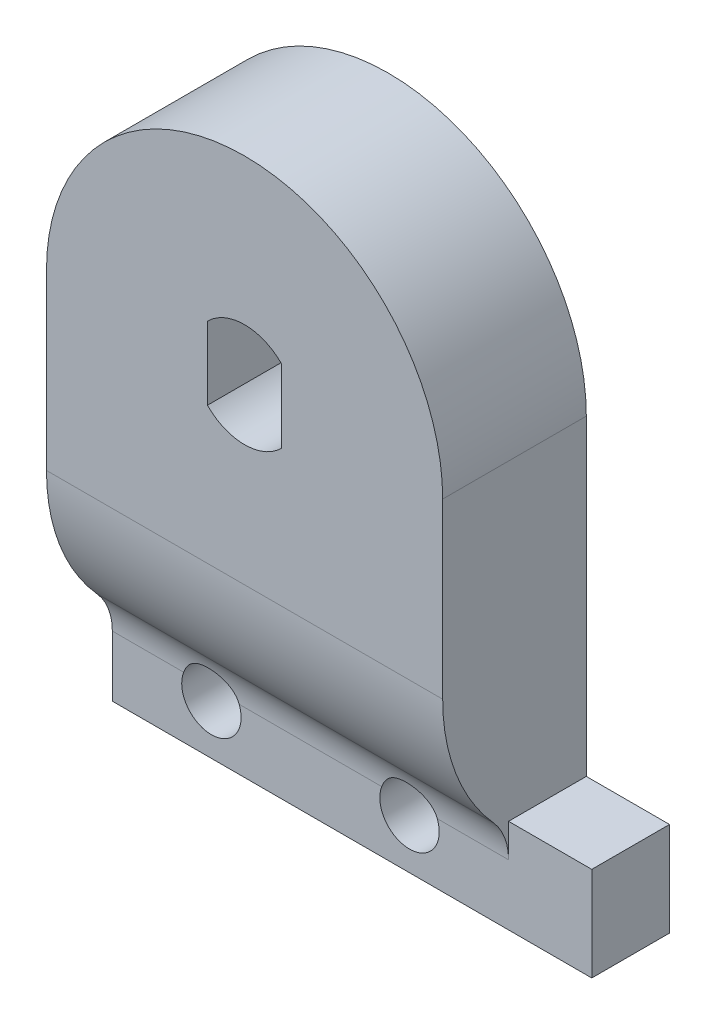
ISO-10303-21;
HEADER;
FILE_DESCRIPTION(('STEP AP214'),'2;1');
FILE_NAME('part.step','',(''),(''),'','','');
FILE_SCHEMA(('AUTOMOTIVE_DESIGN { 1 0 10303 214 1 1 1 1 }'));
ENDSEC;
DATA;
#1=APPLICATION_CONTEXT('core data for automotive mechanical design processes');
#2=APPLICATION_PROTOCOL_DEFINITION('international standard','automotive_design',2000,#1);
#3=PRODUCT_CONTEXT('',#1,'mechanical');
#4=PRODUCT('Part','Part','',(#3));
#5=PRODUCT_RELATED_PRODUCT_CATEGORY('part','',(#4));
#6=PRODUCT_DEFINITION_FORMATION('','',#4);
#7=PRODUCT_DEFINITION_CONTEXT('part definition',#1,'design');
#8=PRODUCT_DEFINITION('design','',#6,#7);
#9=PRODUCT_DEFINITION_SHAPE('','',#8);
#10=(LENGTH_UNIT() NAMED_UNIT(*) SI_UNIT(.MILLI.,.METRE.));
#11=(NAMED_UNIT(*) PLANE_ANGLE_UNIT() SI_UNIT($,.RADIAN.));
#12=(NAMED_UNIT(*) SI_UNIT($,.STERADIAN.) SOLID_ANGLE_UNIT());
#13=UNCERTAINTY_MEASURE_WITH_UNIT(LENGTH_MEASURE(1.E-05),#10,'distance_accuracy_value','');
#14=(GEOMETRIC_REPRESENTATION_CONTEXT(3) GLOBAL_UNCERTAINTY_ASSIGNED_CONTEXT((#13)) GLOBAL_UNIT_ASSIGNED_CONTEXT((#10,
#11,#12)) REPRESENTATION_CONTEXT('',''));
#15=CARTESIAN_POINT('',(0.,0.,0.));
#16=DIRECTION('',(0.,0.,1.));
#17=DIRECTION('',(1.,0.,0.));
#18=AXIS2_PLACEMENT_3D('',#15,#16,#17);
#19=CARTESIAN_POINT('',(44.2641007815363,-13.9999999999999,8.));
#20=DIRECTION('',(1.,0.,0.));
#21=DIRECTION('',(0.,0.,-1.));
#22=AXIS2_PLACEMENT_3D('',#19,#20,#21);
#23=PLANE('',#22);
#24=DIRECTION('',(0.,1.,0.));
#25=VECTOR('',#24,1.);
#26=CARTESIAN_POINT('',(44.2641007815363,-29.7499999999998,0.75));
#27=LINE('',#26,#25);
#28=CARTESIAN_POINT('',(44.2641007815363,-34.4999999999998,0.75));
#29=VERTEX_POINT('',#28);
#30=CARTESIAN_POINT('',(44.2641007815363,-13.9999999999999,0.75));
#31=VERTEX_POINT('',#30);
#32=EDGE_CURVE('E151',#29,#31,#27,.T.);
#33=ORIENTED_EDGE('',*,*,#32,.F.);
#34=DIRECTION('',(0.,0.,1.));
#35=VECTOR('',#34,1.);
#36=CARTESIAN_POINT('',(44.2641007815363,-34.4999999999998,4.67499999999996));
#37=LINE('',#36,#35);
#38=CARTESIAN_POINT('',(44.2641007815363,-34.4999999999998,4.67499999999996));
#39=VERTEX_POINT('',#38);
#40=EDGE_CURVE('E145',#29,#39,#37,.T.);
#41=ORIENTED_EDGE('',*,*,#40,.T.);
#42=DIRECTION('',(0.,1.,0.));
#43=VECTOR('',#42,1.);
#44=CARTESIAN_POINT('',(44.2641007815363,-31.432993435446,4.67499999999996));
#45=LINE('',#44,#43);
#46=CARTESIAN_POINT('',(44.2641007815363,-31.432993435446,4.67499999999995));
#47=VERTEX_POINT('',#46);
#48=EDGE_CURVE('E148',#39,#47,#45,.T.);
#49=ORIENTED_EDGE('',*,*,#48,.T.);
#50=CARTESIAN_POINT('',(44.2641007815363,-31.432993435446,7.67499999999995));
#51=DIRECTION('',(1.,0.,0.));
#52=DIRECTION('',(0.,0.,1.));
#53=AXIS2_PLACEMENT_3D('',#50,#51,#52);
#54=CIRCLE('',#53,3.);
#55=CARTESIAN_POINT('',(44.2641007815363,-29.4292257195738,5.44230769230766));
#56=VERTEX_POINT('',#55);
#57=EDGE_CURVE('E163',#47,#56,#54,.T.);
#58=ORIENTED_EDGE('',*,*,#57,.T.);
#59=CARTESIAN_POINT('',(44.2641007815363,-22.7499999999998,-2.));
#60=DIRECTION('',(1.,0.,0.));
#61=DIRECTION('',(0.,0.,-1.));
#62=AXIS2_PLACEMENT_3D('',#59,#60,#61);
#63=CIRCLE('',#62,10.);
#64=CARTESIAN_POINT('',(44.2641007815363,-22.7499999999998,8.));
#65=VERTEX_POINT('',#64);
#66=EDGE_CURVE('E246',#56,#65,#63,.F.);
#67=ORIENTED_EDGE('',*,*,#66,.T.);
#68=DIRECTION('',(0.,-1.,0.));
#69=VECTOR('',#68,1.);
#70=CARTESIAN_POINT('',(44.2641007815363,-13.9999999999999,8.));
#71=LINE('',#70,#69);
#72=CARTESIAN_POINT('',(44.2641007815363,-13.9999999999999,8.));
#73=VERTEX_POINT('',#72);
#74=EDGE_CURVE('E233',#73,#65,#71,.T.);
#75=ORIENTED_EDGE('',*,*,#74,.F.);
#76=DIRECTION('',(0.,0.,-1.));
#77=VECTOR('',#76,1.);
#78=CARTESIAN_POINT('',(44.2641007815363,-13.9999999999999,8.));
#79=LINE('',#78,#77);
#80=EDGE_CURVE('E242',#73,#31,#79,.T.);
#81=ORIENTED_EDGE('',*,*,#80,.T.);
#82=EDGE_LOOP('',(#33,#41,#49,#58,#67,#75,#81));
#83=FACE_BOUND('',#82,.T.);
#84=ADVANCED_FACE('F37',(#83),#23,.F.);
#85=CARTESIAN_POINT('',(64.2641007815364,-29.7499999999998,-55.4339173674038));
#86=DIRECTION('',(0.,-1.,0.));
#87=DIRECTION('',(0.,0.,-1.));
#88=AXIS2_PLACEMENT_3D('',#85,#86,#87);
#89=PLANE('',#88);
#90=DIRECTION('',(1.,0.,0.));
#91=VECTOR('',#90,1.);
#92=CARTESIAN_POINT('',(64.2641007815364,-29.7499999999998,0.750000000000001));
#93=LINE('',#92,#91);
#94=CARTESIAN_POINT('',(64.2641007815364,-29.7499999999998,0.750000000000001));
#95=VERTEX_POINT('',#94);
#96=CARTESIAN_POINT('',(68.4641007815364,-29.7499999999998,0.75));
#97=VERTEX_POINT('',#96);
#98=EDGE_CURVE('E178',#95,#97,#93,.T.);
#99=ORIENTED_EDGE('',*,*,#98,.F.);
#100=DIRECTION('',(0.,0.,1.));
#101=VECTOR('',#100,1.);
#102=CARTESIAN_POINT('',(64.2641007815364,-29.7499999999998,8.));
#103=LINE('',#102,#101);
#104=CARTESIAN_POINT('',(64.2641007815364,-29.7499999999998,4.67499999999996));
#105=VERTEX_POINT('',#104);
#106=EDGE_CURVE('E192',#95,#105,#103,.T.);
#107=ORIENTED_EDGE('',*,*,#106,.T.);
#108=DIRECTION('',(1.,0.,0.));
#109=VECTOR('',#108,1.);
#110=CARTESIAN_POINT('',(63.6186870544907,-29.7499999999998,4.67499999999996));
#111=LINE('',#110,#109);
#112=CARTESIAN_POINT('',(68.4641007815364,-29.7499999999998,4.67499999999996));
#113=VERTEX_POINT('',#112);
#114=EDGE_CURVE('E183',#105,#113,#111,.T.);
#115=ORIENTED_EDGE('',*,*,#114,.T.);
#116=DIRECTION('',(0.,0.,-1.));
#117=VECTOR('',#116,1.);
#118=CARTESIAN_POINT('',(68.4641007815364,-29.7499999999998,8.));
#119=LINE('',#118,#117);
#120=EDGE_CURVE('E195',#113,#97,#119,.T.);
#121=ORIENTED_EDGE('',*,*,#120,.T.);
#122=EDGE_LOOP('',(#99,#107,#115,#121));
#123=FACE_BOUND('',#122,.T.);
#124=ADVANCED_FACE('F282',(#123),#89,.F.);
#125=CARTESIAN_POINT('',(68.4641007815364,-42.5841809112374,-2.50000000000004));
#126=DIRECTION('',(-1.,0.,0.));
#127=DIRECTION('',(0.,0.,1.));
#128=AXIS2_PLACEMENT_3D('',#125,#126,#127);
#129=PLANE('',#128);
#130=DIRECTION('',(0.,-1.,0.));
#131=VECTOR('',#130,1.);
#132=CARTESIAN_POINT('',(68.4641007815364,-30.1960979714209,4.67499999999996));
#133=LINE('',#132,#131);
#134=CARTESIAN_POINT('',(68.4641007815364,-34.4999999999998,4.67499999999996));
#135=VERTEX_POINT('',#134);
#136=EDGE_CURVE('E188',#113,#135,#133,.T.);
#137=ORIENTED_EDGE('',*,*,#136,.T.);
#138=DIRECTION('',(0.,0.,1.));
#139=VECTOR('',#138,1.);
#140=CARTESIAN_POINT('',(68.4641007815364,-34.4999999999989,8.));
#141=LINE('',#140,#139);
#142=CARTESIAN_POINT('',(68.4641007815364,-34.4999999999998,0.75));
#143=VERTEX_POINT('',#142);
#144=EDGE_CURVE('E167',#143,#135,#141,.T.);
#145=ORIENTED_EDGE('',*,*,#144,.F.);
#146=DIRECTION('',(0.,-1.,0.));
#147=VECTOR('',#146,1.);
#148=CARTESIAN_POINT('',(68.4641007815364,-34.4999999999998,0.75));
#149=LINE('',#148,#147);
#150=EDGE_CURVE('E169',#97,#143,#149,.T.);
#151=ORIENTED_EDGE('',*,*,#150,.F.);
#152=ORIENTED_EDGE('',*,*,#120,.F.);
#153=EDGE_LOOP('',(#137,#145,#151,#152));
#154=FACE_BOUND('',#153,.T.);
#155=ADVANCED_FACE('F276',(#154),#129,.F.);
#156=CARTESIAN_POINT('',(56.2641007815364,-34.4999999999998,4.67499999999996));
#157=DIRECTION('',(0.,-1.,0.));
#158=DIRECTION('',(0.,0.,-1.));
#159=AXIS2_PLACEMENT_3D('',#156,#157,#158);
#160=PLANE('',#159);
#161=ORIENTED_EDGE('',*,*,#40,.F.);
#162=DIRECTION('',(-1.,0.,0.));
#163=VECTOR('',#162,1.);
#164=CARTESIAN_POINT('',(68.4641007815364,-34.4999999999998,0.75));
#165=LINE('',#164,#163);
#166=EDGE_CURVE('E171',#143,#29,#165,.T.);
#167=ORIENTED_EDGE('',*,*,#166,.F.);
#168=ORIENTED_EDGE('',*,*,#144,.T.);
#169=DIRECTION('',(-1.,0.,0.));
#170=VECTOR('',#169,1.);
#171=CARTESIAN_POINT('',(69.8783143439095,-34.4999999999998,4.67499999999996));
#172=LINE('',#171,#170);
#173=EDGE_CURVE('E160',#135,#39,#172,.T.);
#174=ORIENTED_EDGE('',*,*,#173,.T.);
#175=EDGE_LOOP('',(#161,#167,#168,#174));
#176=FACE_BOUND('',#175,.T.);
#177=ADVANCED_FACE('F165',(#176),#160,.T.);
#178=CARTESIAN_POINT('',(59.2641007815363,-31.9646128597868,-28.));
#179=DIRECTION('',(0.,0.,1.));
#180=DIRECTION('',(1.,0.,0.));
#181=AXIS2_PLACEMENT_3D('',#178,#179,#180);
#182=CYLINDRICAL_SURFACE('',#181,1.5);
#183=CARTESIAN_POINT('',(57.8614672628781,-31.432993435446,4.67499999999995));
#184=CARTESIAN_POINT('',(57.8905351969613,-31.356313199977,4.67500314403333));
#185=CARTESIAN_POINT('',(57.9259412826313,-31.2819562733326,4.67796667743639));
#186=CARTESIAN_POINT('',(58.0082848743271,-31.1401889312916,4.68847211900364));
#187=CARTESIAN_POINT('',(58.0552445361,-31.0727922199422,4.69602286521372));
#188=CARTESIAN_POINT('',(58.1590864797405,-30.946982483888,4.71394977751054));
#189=CARTESIAN_POINT('',(58.2159339739823,-30.8885392712706,4.72431610724775));
#190=CARTESIAN_POINT('',(58.338194111731,-30.7816968721352,4.7460427298524));
#191=CARTESIAN_POINT('',(58.4036056668758,-30.7332964113525,4.75740289635751));
#192=CARTESIAN_POINT('',(58.5444588190816,-30.6457962484212,4.77975359402547));
#193=CARTESIAN_POINT('',(58.6202099986338,-30.6071836455321,4.79070745835738));
#194=CARTESIAN_POINT('',(58.777454224866,-30.5432140250815,4.80979224109244));
#195=CARTESIAN_POINT('',(58.8589460505222,-30.5178541982843,4.81792375763533));
#196=CARTESIAN_POINT('',(59.0239730730645,-30.4815912053632,4.82979399182506));
#197=CARTESIAN_POINT('',(59.1074511582754,-30.4704529434594,4.83360402614734));
#198=CARTESIAN_POINT('',(59.2751627745851,-30.4623074844926,4.83637524162235));
#199=CARTESIAN_POINT('',(59.3593960946352,-30.4652964553428,4.83533773769642));
#200=CARTESIAN_POINT('',(59.5222193685981,-30.4848165798267,4.82876493565629));
#201=CARTESIAN_POINT('',(59.6008927259389,-30.500732456763,4.82343408131985));
#202=CARTESIAN_POINT('',(59.7544299748945,-30.5447681329138,4.80941368093745));
#203=CARTESIAN_POINT('',(59.8292930457287,-30.5728905492338,4.80072341467086));
#204=CARTESIAN_POINT('',(59.97518835872,-30.6413556575037,4.78110934983329));
#205=CARTESIAN_POINT('',(60.046079286399,-30.6819844976158,4.77013544096591));
#206=CARTESIAN_POINT('',(60.1803268357982,-30.7741659547394,4.74785279034464));
#207=CARTESIAN_POINT('',(60.2436809798132,-30.8257221486913,4.73654393999691));
#208=CARTESIAN_POINT('',(60.3638974288669,-30.9410502871762,4.71500428682771));
#209=CARTESIAN_POINT('',(60.4203579070841,-31.0052557696872,4.70484170093883));
#210=CARTESIAN_POINT('',(60.5217392218721,-31.1426479123439,4.68828356953832));
#211=CARTESIAN_POINT('',(60.5666638684875,-31.2158315953456,4.6818867793583));
#212=CARTESIAN_POINT('',(60.6420716133165,-31.3662684366982,4.67483228984156));
#213=CARTESIAN_POINT('',(60.6730174596529,-31.4432793513059,4.67397576714087));
#214=CARTESIAN_POINT('',(60.7217411385435,-31.6011578210443,4.67867852731586));
#215=CARTESIAN_POINT('',(60.7395262141679,-31.6820232287189,4.68423427686184));
#216=CARTESIAN_POINT('',(60.7607965546,-31.8391250879013,4.70164007904868));
#217=CARTESIAN_POINT('',(60.7651901707445,-31.9152924163712,4.71302559050636));
#218=CARTESIAN_POINT('',(60.7625540567552,-32.0663146486848,4.74160405788756));
#219=CARTESIAN_POINT('',(60.7555232154192,-32.141169424147,4.75879757859947));
#220=CARTESIAN_POINT('',(60.7306487152274,-32.2884682080586,4.79853489080101));
#221=CARTESIAN_POINT('',(60.7126857806908,-32.3608761883924,4.82113600767854));
#222=CARTESIAN_POINT('',(60.6668775297469,-32.5009460082514,4.87053903199488));
#223=CARTESIAN_POINT('',(60.6390298239862,-32.5686066955177,4.89734195422142));
#224=CARTESIAN_POINT('',(60.5708518380334,-32.705482758741,4.95710488925076));
#225=CARTESIAN_POINT('',(60.5294706762182,-32.7740188153254,4.99041833010023));
#226=CARTESIAN_POINT('',(60.4368964443848,-32.9031624922151,5.05890380091048));
#227=CARTESIAN_POINT('',(60.3856906244186,-32.9637596359242,5.09407820249572));
#228=CARTESIAN_POINT('',(60.2667713098761,-33.0838698767573,5.16895529967573));
#229=CARTESIAN_POINT('',(60.1977615927129,-33.1421262627322,5.2086265556115));
#230=CARTESIAN_POINT('',(60.0489592128074,-33.2461016234704,5.28402661242211));
#231=CARTESIAN_POINT('',(59.9691800704988,-33.2918361042285,5.31976025619709));
#232=CARTESIAN_POINT('',(59.8238156013071,-33.3578666016649,5.37366549071028));
#233=CARTESIAN_POINT('',(59.7606222301458,-33.3816985775829,5.39394359291961));
#234=CARTESIAN_POINT('',(59.6300175731454,-33.4208876005341,5.42801203001535));
#235=CARTESIAN_POINT('',(59.5626131866599,-33.4362581253803,5.44181267730941));
#236=CARTESIAN_POINT('',(59.424553497476,-33.4576515887253,5.46118408816184));
#237=CARTESIAN_POINT('',(59.3538764151949,-33.4635983819606,5.46668779391903));
#238=CARTESIAN_POINT('',(59.2122865113986,-33.4653871507649,5.46833294531659));
#239=CARTESIAN_POINT('',(59.1413737439488,-33.461231302938,5.46447640761267));
#240=CARTESIAN_POINT('',(59.0098141187493,-33.4442203424482,5.44900135076973));
#241=CARTESIAN_POINT('',(58.9489138217425,-33.4324031881345,5.43831085953663));
#242=CARTESIAN_POINT('',(58.8301893174331,-33.4017926793689,5.41132056010683));
#243=CARTESIAN_POINT('',(58.7723677951229,-33.3829933461232,5.39501594544809));
#244=CARTESIAN_POINT('',(58.6377970932507,-33.3302210417367,5.35075018451321));
#245=CARTESIAN_POINT('',(58.5629221917756,-33.2931864896136,5.32074565904682));
#246=CARTESIAN_POINT('',(58.4216578396435,-33.2084374560991,5.25619001280382));
#247=CARTESIAN_POINT('',(58.3552821020202,-33.160706048655,5.22163172253145));
#248=CARTESIAN_POINT('',(58.2304846805721,-33.0547718222631,5.15032536391708));
#249=CARTESIAN_POINT('',(58.1722212888293,-32.9964014273871,5.11354967597669));
#250=CARTESIAN_POINT('',(58.0657855726871,-32.8706086531321,5.04088878372327));
#251=CARTESIAN_POINT('',(58.0176130657444,-32.8031864375363,5.00500356331209));
#252=CARTESIAN_POINT('',(57.9276957570148,-32.6520638576877,4.93243771948099));
#253=CARTESIAN_POINT('',(57.8872787110229,-32.5673858438956,4.89611966041895));
#254=CARTESIAN_POINT('',(57.8224878869317,-32.3896649496212,4.83005142055265));
#255=CARTESIAN_POINT('',(57.7981043157186,-32.2966272147374,4.80029723798134));
#256=CARTESIAN_POINT('',(57.7692857549199,-32.1160365043674,4.75246972310036));
#257=CARTESIAN_POINT('',(57.7629170839407,-32.0290419433271,4.73345953711122));
#258=CARTESIAN_POINT('',(57.7656395522434,-31.8540266088968,4.7033733719303));
#259=CARTESIAN_POINT('',(57.7746945156388,-31.7660087164245,4.69227891309168));
#260=CARTESIAN_POINT('',(57.7995959621934,-31.6374154530048,4.68167413282523));
#261=CARTESIAN_POINT('',(57.809509162071,-31.5958433020205,4.67914022693855));
#262=CARTESIAN_POINT('',(57.8328626351841,-31.5136345519112,4.67580246362784));
#263=CARTESIAN_POINT('',(57.846302405655,-31.4729978203258,4.67499835974519));
#264=CARTESIAN_POINT('',(57.8614672628781,-31.432993435446,4.67499999999995));
#265=B_SPLINE_CURVE_WITH_KNOTS('',3,(#183,#184,#185,#186,#187,#188,#189,#190,#191,#192,#193,
#194,#195,#196,#197,#198,#199,#200,#201,#202,#203,#204,#205,#206,#207,#208,#209,#210,#211,#212,
#213,#214,#215,#216,#217,#218,#219,#220,#221,#222,#223,#224,#225,#226,#227,#228,#229,#230,#231,
#232,#233,#234,#235,#236,#237,#238,#239,#240,#241,#242,#243,#244,#245,#246,#247,#248,#249,#250,
#251,#252,#253,#254,#255,#256,#257,#258,#259,#260,#261,#262,#263,#264),.UNSPECIFIED.,.T.,.F.,(4,
2,2,2,2,2,2,2,2,2,2,2,2,2,2,2,2,2,2,2,2,2,2,2,2,2,2,2,2,2,2,2,2,2,2,2,2,2,2,2,4),(0.,
0.24584263724966,0.492160440983074,0.737628552881246,0.983065499732747,1.23901380886139,
1.494907841735,1.74651448866019,1.99805288986491,2.2382752355539,2.47854911083427,
2.72479025180429,2.97111212174008,3.22813975584287,3.48508238957078,3.7327504388118,
3.98028208160891,4.21060146721951,4.44094325623466,4.67384442589395,4.90680193095566,
5.16593118930089,5.42539903540851,5.71998390552178,6.01420232134983,6.22497311611074,
6.43540720619403,6.64753312262325,6.85961334077913,7.04768723238372,7.23592254312532,
7.50076800137192,7.76603553160844,8.03591343425972,8.30578645441611,8.60594128294028,
8.90591260865847,9.17217717152422,9.43781807474397,9.56609343739053,9.69435052241715),.UNSPECIFIED.);
#266=CARTESIAN_POINT('',(57.8614672628781,-31.432993435446,4.67499999999995));
#267=VERTEX_POINT('',#266);
#268=CARTESIAN_POINT('',(60.6667343001946,-31.432993435446,4.67499999999996));
#269=VERTEX_POINT('',#268);
#270=EDGE_CURVE('E47',#267,#269,#265,.T.);
#271=ORIENTED_EDGE('',*,*,#270,.F.);
#272=CARTESIAN_POINT('',(59.2641007815363,-31.9646128597868,4.67499999999995));
#273=DIRECTION('',(0.,0.,-1.));
#274=DIRECTION('',(0.,1.,0.));
#275=AXIS2_PLACEMENT_3D('',#272,#273,#274);
#276=CIRCLE('',#275,1.5);
#277=EDGE_CURVE('E59',#269,#267,#276,.T.);
#278=ORIENTED_EDGE('',*,*,#277,.F.);
#279=EDGE_LOOP('',(#271,#278));
#280=FACE_BOUND('',#279,.T.);
#281=CARTESIAN_POINT('',(59.2641007815363,-31.9646128597868,0.750000000000001));
#282=DIRECTION('',(0.,0.,-1.));
#283=DIRECTION('',(0.,1.,0.));
#284=AXIS2_PLACEMENT_3D('',#281,#282,#283);
#285=CIRCLE('',#284,1.5);
#286=CARTESIAN_POINT('',(59.2641007815363,-30.4646128597868,0.750000000000001));
#287=VERTEX_POINT('',#286);
#288=EDGE_CURVE('E175',#287,#287,#285,.F.);
#289=ORIENTED_EDGE('',*,*,#288,.F.);
#290=EDGE_LOOP('',(#289));
#291=FACE_BOUND('',#290,.T.);
#292=ADVANCED_FACE('F268',(#280,#291),#182,.F.);
#293=CARTESIAN_POINT('',(49.2641007815364,-31.9646128597868,-28.));
#294=DIRECTION('',(0.,0.,1.));
#295=DIRECTION('',(1.,0.,0.));
#296=AXIS2_PLACEMENT_3D('',#293,#294,#295);
#297=CYLINDRICAL_SURFACE('',#296,1.5);
#298=CARTESIAN_POINT('',(47.8614672628781,-31.432993435446,4.67499999999995));
#299=CARTESIAN_POINT('',(47.8905351969613,-31.356313199977,4.67500314403333));
#300=CARTESIAN_POINT('',(47.9259412826314,-31.2819562733326,4.67796667743639));
#301=CARTESIAN_POINT('',(48.0082848743271,-31.1401889312916,4.68847211900364));
#302=CARTESIAN_POINT('',(48.0552445361,-31.0727922199422,4.69602286521372));
#303=CARTESIAN_POINT('',(48.1590864797405,-30.946982483888,4.71394977751054));
#304=CARTESIAN_POINT('',(48.2159339739823,-30.8885392712706,4.72431610724775));
#305=CARTESIAN_POINT('',(48.338194111731,-30.7816968721352,4.7460427298524));
#306=CARTESIAN_POINT('',(48.4036056668758,-30.7332964113525,4.75740289635751));
#307=CARTESIAN_POINT('',(48.5444588190816,-30.6457962484212,4.77975359402547));
#308=CARTESIAN_POINT('',(48.6202099986339,-30.6071836455321,4.79070745835738));
#309=CARTESIAN_POINT('',(48.777454224866,-30.5432140250815,4.80979224109244));
#310=CARTESIAN_POINT('',(48.8589460505222,-30.5178541982843,4.81792375763533));
#311=CARTESIAN_POINT('',(49.0239730730645,-30.4815912053632,4.82979399182506));
#312=CARTESIAN_POINT('',(49.1074511582754,-30.4704529434594,4.83360402614734));
#313=CARTESIAN_POINT('',(49.2751627745851,-30.4623074844926,4.83637524162235));
#314=CARTESIAN_POINT('',(49.3593960946352,-30.4652964553428,4.83533773769642));
#315=CARTESIAN_POINT('',(49.5222193685981,-30.4848165798267,4.82876493565629));
#316=CARTESIAN_POINT('',(49.6008927259389,-30.500732456763,4.82343408131985));
#317=CARTESIAN_POINT('',(49.7544299748945,-30.5447681329138,4.80941368093745));
#318=CARTESIAN_POINT('',(49.8292930457287,-30.5728905492338,4.80072341467086));
#319=CARTESIAN_POINT('',(49.97518835872,-30.6413556575037,4.78110934983329));
#320=CARTESIAN_POINT('',(50.046079286399,-30.6819844976158,4.77013544096591));
#321=CARTESIAN_POINT('',(50.1803268357982,-30.7741659547394,4.74785279034464));
#322=CARTESIAN_POINT('',(50.2436809798132,-30.8257221486913,4.73654393999691));
#323=CARTESIAN_POINT('',(50.3638974288669,-30.9410502871762,4.71500428682771));
#324=CARTESIAN_POINT('',(50.4203579070841,-31.0052557696872,4.70484170093883));
#325=CARTESIAN_POINT('',(50.5217392218721,-31.1426479123439,4.68828356953832));
#326=CARTESIAN_POINT('',(50.5666638684875,-31.2158315953456,4.6818867793583));
#327=CARTESIAN_POINT('',(50.6420716133165,-31.3662684366982,4.67483228984156));
#328=CARTESIAN_POINT('',(50.6730174596529,-31.4432793513059,4.67397576714087));
#329=CARTESIAN_POINT('',(50.7217411385435,-31.6011578210443,4.67867852731586));
#330=CARTESIAN_POINT('',(50.7395262141679,-31.6820232287189,4.68423427686184));
#331=CARTESIAN_POINT('',(50.7607965546,-31.8391250879013,4.70164007904868));
#332=CARTESIAN_POINT('',(50.7651901707445,-31.9152924163712,4.71302559050636));
#333=CARTESIAN_POINT('',(50.7625540567552,-32.0663146486848,4.74160405788756));
#334=CARTESIAN_POINT('',(50.7555232154192,-32.141169424147,4.75879757859947));
#335=CARTESIAN_POINT('',(50.7306487152274,-32.2884682080586,4.79853489080101));
#336=CARTESIAN_POINT('',(50.7126857806908,-32.3608761883924,4.82113600767854));
#337=CARTESIAN_POINT('',(50.6668775297469,-32.5009460082514,4.87053903199488));
#338=CARTESIAN_POINT('',(50.6390298239862,-32.5686066955177,4.89734195422142));
#339=CARTESIAN_POINT('',(50.5708518380334,-32.705482758741,4.95710488925076));
#340=CARTESIAN_POINT('',(50.5294706762182,-32.7740188153254,4.99041833010023));
#341=CARTESIAN_POINT('',(50.4368964443848,-32.9031624922151,5.05890380091048));
#342=CARTESIAN_POINT('',(50.3856906244186,-32.9637596359242,5.09407820249572));
#343=CARTESIAN_POINT('',(50.2667713098761,-33.0838698767573,5.16895529967573));
#344=CARTESIAN_POINT('',(50.1977615927129,-33.1421262627322,5.2086265556115));
#345=CARTESIAN_POINT('',(50.0489592128074,-33.2461016234704,5.28402661242211));
#346=CARTESIAN_POINT('',(49.9691800704988,-33.2918361042285,5.31976025619709));
#347=CARTESIAN_POINT('',(49.8238156013071,-33.3578666016649,5.37366549071028));
#348=CARTESIAN_POINT('',(49.7606222301458,-33.3816985775829,5.39394359291961));
#349=CARTESIAN_POINT('',(49.6300175731454,-33.4208876005341,5.42801203001535));
#350=CARTESIAN_POINT('',(49.5626131866599,-33.4362581253803,5.44181267730941));
#351=CARTESIAN_POINT('',(49.424553497476,-33.4576515887253,5.46118408816184));
#352=CARTESIAN_POINT('',(49.3538764151949,-33.4635983819606,5.46668779391903));
#353=CARTESIAN_POINT('',(49.2122865113986,-33.4653871507649,5.46833294531659));
#354=CARTESIAN_POINT('',(49.1413737439488,-33.461231302938,5.46447640761267));
#355=CARTESIAN_POINT('',(49.0098141187493,-33.4442203424482,5.44900135076973));
#356=CARTESIAN_POINT('',(48.9489138217425,-33.4324031881345,5.43831085953663));
#357=CARTESIAN_POINT('',(48.8301893174331,-33.4017926793689,5.41132056010683));
#358=CARTESIAN_POINT('',(48.772367795123,-33.3829933461232,5.39501594544809));
#359=CARTESIAN_POINT('',(48.6377970932507,-33.3302210417367,5.35075018451321));
#360=CARTESIAN_POINT('',(48.5629221917756,-33.2931864896136,5.32074565904682));
#361=CARTESIAN_POINT('',(48.4216578396435,-33.2084374560991,5.25619001280381));
#362=CARTESIAN_POINT('',(48.3552821020202,-33.160706048655,5.22163172253145));
#363=CARTESIAN_POINT('',(48.2304846805721,-33.0547718222631,5.15032536391708));
#364=CARTESIAN_POINT('',(48.1722212888293,-32.9964014273871,5.11354967597669));
#365=CARTESIAN_POINT('',(48.0657855726871,-32.8706086531321,5.04088878372327));
#366=CARTESIAN_POINT('',(48.0176130657444,-32.8031864375363,5.00500356331209));
#367=CARTESIAN_POINT('',(47.9276957570148,-32.6520638576877,4.93243771948099));
#368=CARTESIAN_POINT('',(47.8872787110229,-32.5673858438956,4.89611966041895));
#369=CARTESIAN_POINT('',(47.8224878869317,-32.3896649496212,4.83005142055265));
#370=CARTESIAN_POINT('',(47.7981043157186,-32.2966272147374,4.80029723798134));
#371=CARTESIAN_POINT('',(47.7692857549199,-32.1160365043674,4.75246972310036));
#372=CARTESIAN_POINT('',(47.7629170839407,-32.0290419433271,4.73345953711122));
#373=CARTESIAN_POINT('',(47.7656395522434,-31.8540266088968,4.7033733719303));
#374=CARTESIAN_POINT('',(47.7746945156388,-31.7660087164245,4.69227891309168));
#375=CARTESIAN_POINT('',(47.7995959621934,-31.6374154530048,4.68167413282523));
#376=CARTESIAN_POINT('',(47.809509162071,-31.5958433020205,4.67914022693855));
#377=CARTESIAN_POINT('',(47.8328626351841,-31.5136345519112,4.67580246362784));
#378=CARTESIAN_POINT('',(47.846302405655,-31.4729978203258,4.67499835974519));
#379=CARTESIAN_POINT('',(47.8614672628781,-31.432993435446,4.67499999999995));
#380=B_SPLINE_CURVE_WITH_KNOTS('',3,(#298,#299,#300,#301,#302,#303,#304,#305,#306,#307,#308,
#309,#310,#311,#312,#313,#314,#315,#316,#317,#318,#319,#320,#321,#322,#323,#324,#325,#326,#327,
#328,#329,#330,#331,#332,#333,#334,#335,#336,#337,#338,#339,#340,#341,#342,#343,#344,#345,#346,
#347,#348,#349,#350,#351,#352,#353,#354,#355,#356,#357,#358,#359,#360,#361,#362,#363,#364,#365,
#366,#367,#368,#369,#370,#371,#372,#373,#374,#375,#376,#377,#378,#379),.UNSPECIFIED.,.T.,.F.,(4,
2,2,2,2,2,2,2,2,2,2,2,2,2,2,2,2,2,2,2,2,2,2,2,2,2,2,2,2,2,2,2,2,2,2,2,2,2,2,2,4),(0.,
0.24584263724966,0.492160440983074,0.737628552881246,0.983065499732747,1.23901380886139,
1.494907841735,1.74651448866019,1.99805288986491,2.2382752355539,2.47854911083427,
2.72479025180429,2.97111212174008,3.22813975584287,3.48508238957078,3.7327504388118,
3.98028208160891,4.21060146721951,4.44094325623466,4.67384442589395,4.90680193095566,
5.16593118930089,5.42539903540851,5.71998390552178,6.01420232134983,6.22497311611074,
6.43540720619403,6.64753312262325,6.85961334077913,7.04768723238372,7.23592254312532,
7.50076800137192,7.76603553160844,8.03591343425972,8.30578645441611,8.60594128294028,
8.90591260865847,9.17217717152422,9.43781807474397,9.56609343739053,9.69435052241715),.UNSPECIFIED.);
#381=CARTESIAN_POINT('',(47.8614672628781,-31.432993435446,4.67499999999995));
#382=VERTEX_POINT('',#381);
#383=CARTESIAN_POINT('',(50.6667343001946,-31.432993435446,4.67499999999996));
#384=VERTEX_POINT('',#383);
#385=EDGE_CURVE('E11',#382,#384,#380,.T.);
#386=ORIENTED_EDGE('',*,*,#385,.F.);
#387=CARTESIAN_POINT('',(49.2641007815364,-31.9646128597868,4.67499999999995));
#388=DIRECTION('',(0.,0.,-1.));
#389=DIRECTION('',(0.,1.,0.));
#390=AXIS2_PLACEMENT_3D('',#387,#388,#389);
#391=CIRCLE('',#390,1.5);
#392=EDGE_CURVE('E53',#384,#382,#391,.T.);
#393=ORIENTED_EDGE('',*,*,#392,.F.);
#394=EDGE_LOOP('',(#386,#393));
#395=FACE_BOUND('',#394,.T.);
#396=CARTESIAN_POINT('',(49.2641007815364,-31.9646128597868,0.750000000000001));
#397=DIRECTION('',(0.,0.,-1.));
#398=DIRECTION('',(0.,1.,0.));
#399=AXIS2_PLACEMENT_3D('',#396,#397,#398);
#400=CIRCLE('',#399,1.5);
#401=CARTESIAN_POINT('',(49.2641007815364,-30.4646128597868,0.750000000000001));
#402=VERTEX_POINT('',#401);
#403=EDGE_CURVE('E42',#402,#402,#400,.F.);
#404=ORIENTED_EDGE('',*,*,#403,.F.);
#405=EDGE_LOOP('',(#404));
#406=FACE_BOUND('',#405,.T.);
#407=ADVANCED_FACE('F272',(#395,#406),#297,.F.);
#408=CARTESIAN_POINT('',(54.2641007815363,-22.7499999999998,-2.));
#409=DIRECTION('',(1.,0.,0.));
#410=DIRECTION('',(0.,0.,-1.));
#411=AXIS2_PLACEMENT_3D('',#408,#409,#410);
#412=CYLINDRICAL_SURFACE('',#411,10.);
#413=ORIENTED_EDGE('',*,*,#66,.F.);
#414=DIRECTION('',(1.,0.,0.));
#415=VECTOR('',#414,1.);
#416=CARTESIAN_POINT('',(54.2641007815363,-29.4292257195738,5.44230769230766));
#417=LINE('',#416,#415);
#418=CARTESIAN_POINT('',(64.2641007815364,-29.4292257195738,5.44230769230766));
#419=VERTEX_POINT('',#418);
#420=EDGE_CURVE('E254',#56,#419,#417,.T.);
#421=ORIENTED_EDGE('',*,*,#420,.T.);
#422=CARTESIAN_POINT('',(64.2641007815364,-22.7499999999998,-2.));
#423=DIRECTION('',(1.,0.,0.));
#424=DIRECTION('',(0.,0.,-1.));
#425=AXIS2_PLACEMENT_3D('',#422,#423,#424);
#426=CIRCLE('',#425,10.);
#427=CARTESIAN_POINT('',(64.2641007815364,-22.7499999999998,8.));
#428=VERTEX_POINT('',#427);
#429=EDGE_CURVE('E190',#419,#428,#426,.F.);
#430=ORIENTED_EDGE('',*,*,#429,.T.);
#431=DIRECTION('',(-1.,0.,0.));
#432=VECTOR('',#431,1.);
#433=CARTESIAN_POINT('',(54.2641007815363,-22.7499999999998,8.));
#434=LINE('',#433,#432);
#435=EDGE_CURVE('E248',#65,#428,#434,.F.);
#436=ORIENTED_EDGE('',*,*,#435,.F.);
#437=EDGE_LOOP('',(#413,#421,#430,#436));
#438=FACE_BOUND('',#437,.T.);
#439=ADVANCED_FACE('F311',(#438),#412,.T.);
#440=CARTESIAN_POINT('',(54.2641007815363,-13.9999999999999,8.));
#441=DIRECTION('',(0.,0.,1.));
#442=DIRECTION('',(1.,0.,0.));
#443=AXIS2_PLACEMENT_3D('',#440,#441,#442);
#444=PLANE('',#443);
#445=DIRECTION('',(0.,1.,0.));
#446=VECTOR('',#445,1.);
#447=CARTESIAN_POINT('',(56.1391007815363,-12.1628826929125,8.));
#448=LINE('',#447,#446);
#449=CARTESIAN_POINT('',(56.1391007815363,-15.8371173070873,8.));
#450=VERTEX_POINT('',#449);
#451=CARTESIAN_POINT('',(56.1391007815363,-12.1628826929125,8.));
#452=VERTEX_POINT('',#451);
#453=EDGE_CURVE('E219',#450,#452,#448,.T.);
#454=ORIENTED_EDGE('',*,*,#453,.F.);
#455=CARTESIAN_POINT('',(54.2641007815363,-13.9999999999999,8.));
#456=DIRECTION('',(0.,0.,1.));
#457=DIRECTION('',(1.,0.,0.));
#458=AXIS2_PLACEMENT_3D('',#455,#456,#457);
#459=CIRCLE('',#458,2.625);
#460=CARTESIAN_POINT('',(52.3891007815363,-15.8371173070873,8.));
#461=VERTEX_POINT('',#460);
#462=EDGE_CURVE('E211',#461,#450,#459,.T.);
#463=ORIENTED_EDGE('',*,*,#462,.F.);
#464=DIRECTION('',(0.,-1.,0.));
#465=VECTOR('',#464,1.);
#466=CARTESIAN_POINT('',(52.3891007815363,-12.1628826929125,8.));
#467=LINE('',#466,#465);
#468=CARTESIAN_POINT('',(52.3891007815363,-12.1628826929125,8.));
#469=VERTEX_POINT('',#468);
#470=EDGE_CURVE('E212',#469,#461,#467,.T.);
#471=ORIENTED_EDGE('',*,*,#470,.F.);
#472=CARTESIAN_POINT('',(54.2641007815363,-13.9999999999999,8.));
#473=DIRECTION('',(0.,0.,1.));
#474=DIRECTION('',(1.,0.,0.));
#475=AXIS2_PLACEMENT_3D('',#472,#473,#474);
#476=CIRCLE('',#475,2.625);
#477=EDGE_CURVE('E216',#452,#469,#476,.T.);
#478=ORIENTED_EDGE('',*,*,#477,.F.);
#479=EDGE_LOOP('',(#454,#463,#471,#478));
#480=FACE_BOUND('',#479,.T.);
#481=ORIENTED_EDGE('',*,*,#435,.T.);
#482=DIRECTION('',(0.,-1.,0.));
#483=VECTOR('',#482,1.);
#484=CARTESIAN_POINT('',(64.2641007815364,-13.9999999999999,8.));
#485=LINE('',#484,#483);
#486=CARTESIAN_POINT('',(64.2641007815364,-13.9999999999999,8.));
#487=VERTEX_POINT('',#486);
#488=EDGE_CURVE('E236',#487,#428,#485,.T.);
#489=ORIENTED_EDGE('',*,*,#488,.F.);
#490=CARTESIAN_POINT('',(54.2641007815363,-13.9999999999999,8.));
#491=DIRECTION('',(0.,0.,1.));
#492=DIRECTION('',(1.,0.,0.));
#493=AXIS2_PLACEMENT_3D('',#490,#491,#492);
#494=CIRCLE('',#493,10.);
#495=EDGE_CURVE('E231',#487,#73,#494,.T.);
#496=ORIENTED_EDGE('',*,*,#495,.T.);
#497=ORIENTED_EDGE('',*,*,#74,.T.);
#498=EDGE_LOOP('',(#481,#489,#496,#497));
#499=FACE_BOUND('',#498,.T.);
#500=ADVANCED_FACE('F307',(#480,#499),#444,.T.);
#501=CARTESIAN_POINT('',(64.2641007815364,-13.9999999999999,8.));
#502=DIRECTION('',(1.,0.,0.));
#503=DIRECTION('',(0.,0.,-1.));
#504=AXIS2_PLACEMENT_3D('',#501,#502,#503);
#505=PLANE('',#504);
#506=ORIENTED_EDGE('',*,*,#429,.F.);
#507=CARTESIAN_POINT('',(64.2641007815364,-31.432993435446,7.67499999999995));
#508=DIRECTION('',(1.,0.,0.));
#509=DIRECTION('',(0.,0.,-1.));
#510=AXIS2_PLACEMENT_3D('',#507,#508,#509);
#511=CIRCLE('',#510,3.);
#512=CARTESIAN_POINT('',(64.2641007815364,-31.432993435446,4.67499999999996));
#513=VERTEX_POINT('',#512);
#514=EDGE_CURVE('E257',#419,#513,#511,.F.);
#515=ORIENTED_EDGE('',*,*,#514,.T.);
#516=DIRECTION('',(0.,-1.,0.));
#517=VECTOR('',#516,1.);
#518=CARTESIAN_POINT('',(64.2641007815364,-29.7499999999998,4.67499999999996));
#519=LINE('',#518,#517);
#520=EDGE_CURVE('E186',#105,#513,#519,.T.);
#521=ORIENTED_EDGE('',*,*,#520,.F.);
#522=ORIENTED_EDGE('',*,*,#106,.F.);
#523=DIRECTION('',(0.,-1.,0.));
#524=VECTOR('',#523,1.);
#525=CARTESIAN_POINT('',(64.2641007815364,-13.9999999999999,0.75));
#526=LINE('',#525,#524);
#527=CARTESIAN_POINT('',(64.2641007815364,-13.9999999999999,0.75));
#528=VERTEX_POINT('',#527);
#529=EDGE_CURVE('E194',#528,#95,#526,.T.);
#530=ORIENTED_EDGE('',*,*,#529,.F.);
#531=DIRECTION('',(0.,0.,-1.));
#532=VECTOR('',#531,1.);
#533=CARTESIAN_POINT('',(64.2641007815364,-13.9999999999999,8.));
#534=LINE('',#533,#532);
#535=EDGE_CURVE('E239',#487,#528,#534,.T.);
#536=ORIENTED_EDGE('',*,*,#535,.F.);
#537=ORIENTED_EDGE('',*,*,#488,.T.);
#538=EDGE_LOOP('',(#506,#515,#521,#522,#530,#536,#537));
#539=FACE_BOUND('',#538,.T.);
#540=ADVANCED_FACE('F310',(#539),#505,.T.);
#541=CARTESIAN_POINT('',(54.2641007815363,-13.9999999999999,8.));
#542=DIRECTION('',(0.,0.,-1.));
#543=DIRECTION('',(-1.,0.,0.));
#544=AXIS2_PLACEMENT_3D('',#541,#542,#543);
#545=CYLINDRICAL_SURFACE('',#544,10.);
#546=ORIENTED_EDGE('',*,*,#80,.F.);
#547=ORIENTED_EDGE('',*,*,#495,.F.);
#548=ORIENTED_EDGE('',*,*,#535,.T.);
#549=CARTESIAN_POINT('',(54.2641007815363,-13.9999999999999,0.75));
#550=DIRECTION('',(0.,0.,-1.));
#551=DIRECTION('',(-1.,0.,0.));
#552=AXIS2_PLACEMENT_3D('',#549,#550,#551);
#553=CIRCLE('',#552,10.);
#554=EDGE_CURVE('E203',#31,#528,#553,.T.);
#555=ORIENTED_EDGE('',*,*,#554,.F.);
#556=EDGE_LOOP('',(#546,#547,#548,#555));
#557=FACE_BOUND('',#556,.T.);
#558=ADVANCED_FACE('F302',(#557),#545,.T.);
#559=CARTESIAN_POINT('',(56.1391007815363,-12.1628826929125,-34.451743950282));
#560=DIRECTION('',(1.,0.,0.));
#561=DIRECTION('',(0.,0.,-1.));
#562=AXIS2_PLACEMENT_3D('',#559,#560,#561);
#563=PLANE('',#562);
#564=DIRECTION('',(0.,1.,0.));
#565=VECTOR('',#564,1.);
#566=CARTESIAN_POINT('',(56.1391007815363,-12.1628826929125,0.750000000000001));
#567=LINE('',#566,#565);
#568=CARTESIAN_POINT('',(56.1391007815363,-15.8371173070873,0.750000000000001));
#569=VERTEX_POINT('',#568);
#570=CARTESIAN_POINT('',(56.1391007815363,-12.1628826929125,0.750000000000001));
#571=VERTEX_POINT('',#570);
#572=EDGE_CURVE('E209',#569,#571,#567,.T.);
#573=ORIENTED_EDGE('',*,*,#572,.F.);
#574=DIRECTION('',(0.,0.,1.));
#575=VECTOR('',#574,1.);
#576=CARTESIAN_POINT('',(56.1391007815363,-15.8371173070873,-34.451743950282));
#577=LINE('',#576,#575);
#578=EDGE_CURVE('E226',#569,#450,#577,.T.);
#579=ORIENTED_EDGE('',*,*,#578,.T.);
#580=ORIENTED_EDGE('',*,*,#453,.T.);
#581=DIRECTION('',(0.,0.,1.));
#582=VECTOR('',#581,1.);
#583=CARTESIAN_POINT('',(56.1391007815363,-12.1628826929125,-34.451743950282));
#584=LINE('',#583,#582);
#585=EDGE_CURVE('E215',#571,#452,#584,.T.);
#586=ORIENTED_EDGE('',*,*,#585,.F.);
#587=EDGE_LOOP('',(#573,#579,#580,#586));
#588=FACE_BOUND('',#587,.T.);
#589=ADVANCED_FACE('F298',(#588),#563,.F.);
#590=CARTESIAN_POINT('',(54.2641007815363,-13.9999999999999,-34.451743950282));
#591=DIRECTION('',(0.,0.,1.));
#592=DIRECTION('',(1.,0.,0.));
#593=AXIS2_PLACEMENT_3D('',#590,#591,#592);
#594=CYLINDRICAL_SURFACE('',#593,2.625);
#595=CARTESIAN_POINT('',(54.2641007815363,-13.9999999999999,0.750000000000001));
#596=DIRECTION('',(0.,0.,-1.));
#597=DIRECTION('',(-1.,0.,0.));
#598=AXIS2_PLACEMENT_3D('',#595,#596,#597);
#599=CIRCLE('',#598,2.625);
#600=CARTESIAN_POINT('',(52.3891007815363,-12.1628826929125,0.750000000000001));
#601=VERTEX_POINT('',#600);
#602=EDGE_CURVE('E207',#571,#601,#599,.F.);
#603=ORIENTED_EDGE('',*,*,#602,.F.);
#604=ORIENTED_EDGE('',*,*,#585,.T.);
#605=ORIENTED_EDGE('',*,*,#477,.T.);
#606=DIRECTION('',(0.,0.,1.));
#607=VECTOR('',#606,1.);
#608=CARTESIAN_POINT('',(52.3891007815363,-12.1628826929125,-34.451743950282));
#609=LINE('',#608,#607);
#610=EDGE_CURVE('E227',#601,#469,#609,.T.);
#611=ORIENTED_EDGE('',*,*,#610,.F.);
#612=EDGE_LOOP('',(#603,#604,#605,#611));
#613=FACE_BOUND('',#612,.T.);
#614=ADVANCED_FACE('F294',(#613),#594,.F.);
#615=CARTESIAN_POINT('',(52.3891007815363,-12.1628826929125,-34.451743950282));
#616=DIRECTION('',(-1.,0.,0.));
#617=DIRECTION('',(0.,0.,1.));
#618=AXIS2_PLACEMENT_3D('',#615,#616,#617);
#619=PLANE('',#618);
#620=DIRECTION('',(0.,-1.,0.));
#621=VECTOR('',#620,1.);
#622=CARTESIAN_POINT('',(52.3891007815363,-12.1628826929125,0.750000000000001));
#623=LINE('',#622,#621);
#624=CARTESIAN_POINT('',(52.3891007815363,-15.8371173070873,0.750000000000001));
#625=VERTEX_POINT('',#624);
#626=EDGE_CURVE('E205',#601,#625,#623,.T.);
#627=ORIENTED_EDGE('',*,*,#626,.F.);
#628=ORIENTED_EDGE('',*,*,#610,.T.);
#629=ORIENTED_EDGE('',*,*,#470,.T.);
#630=DIRECTION('',(0.,0.,1.));
#631=VECTOR('',#630,1.);
#632=CARTESIAN_POINT('',(52.3891007815363,-15.8371173070873,-34.451743950282));
#633=LINE('',#632,#631);
#634=EDGE_CURVE('E224',#625,#461,#633,.T.);
#635=ORIENTED_EDGE('',*,*,#634,.F.);
#636=EDGE_LOOP('',(#627,#628,#629,#635));
#637=FACE_BOUND('',#636,.T.);
#638=ADVANCED_FACE('F290',(#637),#619,.F.);
#639=CARTESIAN_POINT('',(54.2641007815363,-13.9999999999999,-34.451743950282));
#640=DIRECTION('',(0.,0.,1.));
#641=DIRECTION('',(1.,0.,0.));
#642=AXIS2_PLACEMENT_3D('',#639,#640,#641);
#643=CYLINDRICAL_SURFACE('',#642,2.625);
#644=CARTESIAN_POINT('',(54.2641007815363,-13.9999999999999,0.750000000000001));
#645=DIRECTION('',(0.,0.,-1.));
#646=DIRECTION('',(-1.,0.,0.));
#647=AXIS2_PLACEMENT_3D('',#644,#645,#646);
#648=CIRCLE('',#647,2.625);
#649=EDGE_CURVE('E244',#625,#569,#648,.F.);
#650=ORIENTED_EDGE('',*,*,#649,.F.);
#651=ORIENTED_EDGE('',*,*,#634,.T.);
#652=ORIENTED_EDGE('',*,*,#462,.T.);
#653=ORIENTED_EDGE('',*,*,#578,.F.);
#654=EDGE_LOOP('',(#650,#651,#652,#653));
#655=FACE_BOUND('',#654,.T.);
#656=ADVANCED_FACE('F286',(#655),#643,.F.);
#657=CARTESIAN_POINT('',(54.2641007815363,-13.9999999999999,0.75));
#658=DIRECTION('',(0.,0.,-1.));
#659=DIRECTION('',(-1.,0.,0.));
#660=AXIS2_PLACEMENT_3D('',#657,#658,#659);
#661=PLANE('',#660);
#662=ORIENTED_EDGE('',*,*,#529,.T.);
#663=ORIENTED_EDGE('',*,*,#98,.T.);
#664=ORIENTED_EDGE('',*,*,#150,.T.);
#665=ORIENTED_EDGE('',*,*,#166,.T.);
#666=ORIENTED_EDGE('',*,*,#32,.T.);
#667=ORIENTED_EDGE('',*,*,#554,.T.);
#668=EDGE_LOOP('',(#662,#663,#664,#665,#666,#667));
#669=FACE_BOUND('',#668,.T.);
#670=ORIENTED_EDGE('',*,*,#572,.T.);
#671=ORIENTED_EDGE('',*,*,#602,.T.);
#672=ORIENTED_EDGE('',*,*,#626,.T.);
#673=ORIENTED_EDGE('',*,*,#649,.T.);
#674=EDGE_LOOP('',(#670,#671,#672,#673));
#675=FACE_BOUND('',#674,.T.);
#676=ORIENTED_EDGE('',*,*,#288,.T.);
#677=EDGE_LOOP('',(#676));
#678=FACE_BOUND('',#677,.T.);
#679=ORIENTED_EDGE('',*,*,#403,.T.);
#680=EDGE_LOOP('',(#679));
#681=FACE_BOUND('',#680,.T.);
#682=ADVANCED_FACE('F279',(#669,#675,#678,#681),#661,.T.);
#683=CARTESIAN_POINT('',(68.4641007815364,-30.1960979714209,4.67499999999996));
#684=DIRECTION('',(0.,0.,-1.));
#685=DIRECTION('',(0.,1.,0.));
#686=AXIS2_PLACEMENT_3D('',#683,#684,#685);
#687=PLANE('',#686);
#688=ORIENTED_EDGE('',*,*,#520,.T.);
#689=DIRECTION('',(1.,0.,0.));
#690=VECTOR('',#689,1.);
#691=CARTESIAN_POINT('',(68.4641007815364,-31.432993435446,4.67499999999996));
#692=LINE('',#691,#690);
#693=EDGE_CURVE('E251',#513,#269,#692,.F.);
#694=ORIENTED_EDGE('',*,*,#693,.T.);
#695=ORIENTED_EDGE('',*,*,#277,.T.);
#696=EDGE_CURVE('E255',#267,#384,#692,.F.);
#697=ORIENTED_EDGE('',*,*,#696,.T.);
#698=ORIENTED_EDGE('',*,*,#392,.T.);
#699=EDGE_CURVE('E162',#382,#47,#692,.F.);
#700=ORIENTED_EDGE('',*,*,#699,.T.);
#701=ORIENTED_EDGE('',*,*,#48,.F.);
#702=ORIENTED_EDGE('',*,*,#173,.F.);
#703=ORIENTED_EDGE('',*,*,#136,.F.);
#704=ORIENTED_EDGE('',*,*,#114,.F.);
#705=EDGE_LOOP('',(#688,#694,#695,#697,#698,#700,#701,#702,#703,#704));
#706=FACE_BOUND('',#705,.T.);
#707=ADVANCED_FACE('F159',(#706),#687,.F.);
#708=CARTESIAN_POINT('',(54.2641007815363,-31.432993435446,7.67499999999995));
#709=DIRECTION('',(1.,0.,0.));
#710=DIRECTION('',(0.,0.,-1.));
#711=AXIS2_PLACEMENT_3D('',#708,#709,#710);
#712=CYLINDRICAL_SURFACE('',#711,3.);
#713=ORIENTED_EDGE('',*,*,#699,.F.);
#714=ORIENTED_EDGE('',*,*,#385,.T.);
#715=ORIENTED_EDGE('',*,*,#696,.F.);
#716=ORIENTED_EDGE('',*,*,#270,.T.);
#717=ORIENTED_EDGE('',*,*,#693,.F.);
#718=ORIENTED_EDGE('',*,*,#514,.F.);
#719=ORIENTED_EDGE('',*,*,#420,.F.);
#720=ORIENTED_EDGE('',*,*,#57,.F.);
#721=EDGE_LOOP('',(#713,#714,#715,#716,#717,#718,#719,#720));
#722=FACE_BOUND('',#721,.T.);
#723=ADVANCED_FACE('F39',(#722),#712,.F.);
#724=CLOSED_SHELL('',(#84,#124,#155,#177,#292,#407,#439,#500,#540,#558,#589,#614,#638,#656,#682,
#707,#723));
#725=MANIFOLD_SOLID_BREP('B2',#724);
#726=ADVANCED_BREP_SHAPE_REPRESENTATION('',(#18,#725),#14);
#727=SHAPE_DEFINITION_REPRESENTATION(#9,#726);
ENDSEC;
END-ISO-10303-21;
